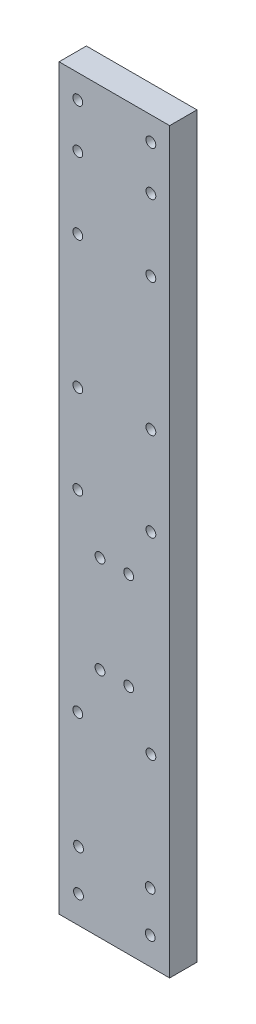
ISO-10303-21;
HEADER;
FILE_DESCRIPTION(('STEP AP214'),'2;1');
FILE_NAME('part.step','',(''),(''),'','','');
FILE_SCHEMA(('AUTOMOTIVE_DESIGN { 1 0 10303 214 1 1 1 1 }'));
ENDSEC;
DATA;
#1=APPLICATION_CONTEXT('core data for automotive mechanical design processes');
#2=APPLICATION_PROTOCOL_DEFINITION('international standard','automotive_design',2000,#1);
#3=PRODUCT_CONTEXT('',#1,'mechanical');
#4=PRODUCT('Part','Part','',(#3));
#5=PRODUCT_RELATED_PRODUCT_CATEGORY('part','',(#4));
#6=PRODUCT_DEFINITION_FORMATION('','',#4);
#7=PRODUCT_DEFINITION_CONTEXT('part definition',#1,'design');
#8=PRODUCT_DEFINITION('design','',#6,#7);
#9=PRODUCT_DEFINITION_SHAPE('','',#8);
#10=(LENGTH_UNIT() NAMED_UNIT(*) SI_UNIT(.MILLI.,.METRE.));
#11=(NAMED_UNIT(*) PLANE_ANGLE_UNIT() SI_UNIT($,.RADIAN.));
#12=(NAMED_UNIT(*) SI_UNIT($,.STERADIAN.) SOLID_ANGLE_UNIT());
#13=UNCERTAINTY_MEASURE_WITH_UNIT(LENGTH_MEASURE(1.E-05),#10,'distance_accuracy_value','');
#14=(GEOMETRIC_REPRESENTATION_CONTEXT(3) GLOBAL_UNCERTAINTY_ASSIGNED_CONTEXT((#13)) GLOBAL_UNIT_ASSIGNED_CONTEXT((#10,
#11,#12)) REPRESENTATION_CONTEXT('',''));
#15=CARTESIAN_POINT('',(0.,0.,0.));
#16=DIRECTION('',(0.,0.,1.));
#17=DIRECTION('',(1.,0.,0.));
#18=AXIS2_PLACEMENT_3D('',#15,#16,#17);
#19=CARTESIAN_POINT('',(0.,0.,4.));
#20=DIRECTION('',(0.,0.,1.));
#21=DIRECTION('',(1.,0.,0.));
#22=AXIS2_PLACEMENT_3D('',#19,#20,#21);
#23=PLANE('',#22);
#24=CARTESIAN_POINT('',(13.35,10.,4.));
#25=DIRECTION('',(0.,0.,1.));
#26=DIRECTION('',(-1.,0.,0.));
#27=AXIS2_PLACEMENT_3D('',#24,#25,#26);
#28=CIRCLE('',#27,0.72);
#29=CARTESIAN_POINT('',(12.63,10.,4.));
#30=VERTEX_POINT('',#29);
#31=EDGE_CURVE('E217',#30,#30,#28,.T.);
#32=ORIENTED_EDGE('',*,*,#31,.F.);
#33=EDGE_LOOP('',(#32));
#34=FACE_BOUND('',#33,.T.);
#35=CARTESIAN_POINT('',(2.85,10.,4.));
#36=DIRECTION('',(0.,0.,1.));
#37=DIRECTION('',(1.,0.,0.));
#38=AXIS2_PLACEMENT_3D('',#35,#36,#37);
#39=CIRCLE('',#38,0.72);
#40=CARTESIAN_POINT('',(3.57,10.,4.));
#41=VERTEX_POINT('',#40);
#42=EDGE_CURVE('E205',#41,#41,#39,.T.);
#43=ORIENTED_EDGE('',*,*,#42,.F.);
#44=EDGE_LOOP('',(#43));
#45=FACE_BOUND('',#44,.T.);
#46=CARTESIAN_POINT('',(2.74999999999998,68.21,4.));
#47=DIRECTION('',(0.,0.,1.));
#48=DIRECTION('',(1.,0.,0.));
#49=AXIS2_PLACEMENT_3D('',#46,#47,#48);
#50=CIRCLE('',#49,0.719999999999994);
#51=CARTESIAN_POINT('',(3.46999999999998,68.21,4.));
#52=VERTEX_POINT('',#51);
#53=EDGE_CURVE('E193',#52,#52,#50,.T.);
#54=ORIENTED_EDGE('',*,*,#53,.F.);
#55=EDGE_LOOP('',(#54));
#56=FACE_BOUND('',#55,.T.);
#57=CARTESIAN_POINT('',(2.74999999999999,55.21,4.));
#58=DIRECTION('',(0.,0.,1.));
#59=DIRECTION('',(1.,0.,0.));
#60=AXIS2_PLACEMENT_3D('',#57,#58,#59);
#61=CIRCLE('',#60,0.720000000000003);
#62=CARTESIAN_POINT('',(3.47,55.21,4.));
#63=VERTEX_POINT('',#62);
#64=EDGE_CURVE('E181',#63,#63,#61,.T.);
#65=ORIENTED_EDGE('',*,*,#64,.F.);
#66=EDGE_LOOP('',(#65));
#67=FACE_BOUND('',#66,.T.);
#68=CARTESIAN_POINT('',(13.45,104.66,4.));
#69=DIRECTION('',(0.,0.,1.));
#70=DIRECTION('',(-1.,0.,0.));
#71=AXIS2_PLACEMENT_3D('',#68,#69,#70);
#72=CIRCLE('',#71,0.71999999999999);
#73=CARTESIAN_POINT('',(12.73,104.66,4.));
#74=VERTEX_POINT('',#73);
#75=EDGE_CURVE('E169',#74,#74,#72,.T.);
#76=ORIENTED_EDGE('',*,*,#75,.F.);
#77=EDGE_LOOP('',(#76));
#78=FACE_BOUND('',#77,.T.);
#79=CARTESIAN_POINT('',(2.74999999999998,87.66,4.));
#80=DIRECTION('',(0.,0.,1.));
#81=DIRECTION('',(-1.,0.,0.));
#82=AXIS2_PLACEMENT_3D('',#79,#80,#81);
#83=CIRCLE('',#82,0.719999999999994);
#84=CARTESIAN_POINT('',(2.02999999999999,87.66,4.));
#85=VERTEX_POINT('',#84);
#86=EDGE_CURVE('E157',#85,#85,#83,.T.);
#87=ORIENTED_EDGE('',*,*,#86,.F.);
#88=EDGE_LOOP('',(#87));
#89=FACE_BOUND('',#88,.T.);
#90=CARTESIAN_POINT('',(2.75,27.,4.));
#91=DIRECTION('',(0.,0.,1.));
#92=DIRECTION('',(1.,0.,0.));
#93=AXIS2_PLACEMENT_3D('',#90,#91,#92);
#94=CIRCLE('',#93,0.72);
#95=CARTESIAN_POINT('',(3.47,27.,4.));
#96=VERTEX_POINT('',#95);
#97=EDGE_CURVE('E145',#96,#96,#94,.T.);
#98=ORIENTED_EDGE('',*,*,#97,.F.);
#99=EDGE_LOOP('',(#98));
#100=FACE_BOUND('',#99,.T.);
#101=CARTESIAN_POINT('',(6.,34.,4.));
#102=DIRECTION('',(0.,0.,1.));
#103=DIRECTION('',(1.,0.,0.));
#104=AXIS2_PLACEMENT_3D('',#101,#102,#103);
#105=CIRCLE('',#104,0.720000000000001);
#106=CARTESIAN_POINT('',(6.72,34.,4.));
#107=VERTEX_POINT('',#106);
#108=EDGE_CURVE('E133',#107,#107,#105,.T.);
#109=ORIENTED_EDGE('',*,*,#108,.F.);
#110=EDGE_LOOP('',(#109));
#111=FACE_BOUND('',#110,.T.);
#112=CARTESIAN_POINT('',(5.99999999999999,48.21,4.));
#113=DIRECTION('',(0.,0.,1.));
#114=DIRECTION('',(1.,0.,0.));
#115=AXIS2_PLACEMENT_3D('',#112,#113,#114);
#116=CIRCLE('',#115,0.720000000000002);
#117=CARTESIAN_POINT('',(6.72,48.21,4.));
#118=VERTEX_POINT('',#117);
#119=EDGE_CURVE('E121',#118,#118,#116,.T.);
#120=ORIENTED_EDGE('',*,*,#119,.F.);
#121=EDGE_LOOP('',(#120));
#122=FACE_BOUND('',#121,.T.);
#123=CARTESIAN_POINT('',(2.74999999999999,104.66,4.));
#124=DIRECTION('',(0.,0.,1.));
#125=DIRECTION('',(1.,0.,0.));
#126=AXIS2_PLACEMENT_3D('',#123,#124,#125);
#127=CIRCLE('',#126,0.719999999999994);
#128=CARTESIAN_POINT('',(3.46999999999998,104.66,4.));
#129=VERTEX_POINT('',#128);
#130=EDGE_CURVE('E100',#129,#129,#127,.T.);
#131=ORIENTED_EDGE('',*,*,#130,.F.);
#132=EDGE_LOOP('',(#131));
#133=FACE_BOUND('',#132,.T.);
#134=DIRECTION('',(0.,-1.,0.));
#135=VECTOR('',#134,1.);
#136=CARTESIAN_POINT('',(0.,108.14,4.));
#137=LINE('',#136,#135);
#138=CARTESIAN_POINT('',(0.,108.14,4.));
#139=VERTEX_POINT('',#138);
#140=CARTESIAN_POINT('',(0.,0.,4.));
#141=VERTEX_POINT('',#140);
#142=EDGE_CURVE('E85',#139,#141,#137,.T.);
#143=ORIENTED_EDGE('',*,*,#142,.T.);
#144=DIRECTION('',(1.,0.,0.));
#145=VECTOR('',#144,1.);
#146=CARTESIAN_POINT('',(0.,0.,4.));
#147=LINE('',#146,#145);
#148=CARTESIAN_POINT('',(16.2,0.,4.));
#149=VERTEX_POINT('',#148);
#150=EDGE_CURVE('E80',#141,#149,#147,.T.);
#151=ORIENTED_EDGE('',*,*,#150,.T.);
#152=DIRECTION('',(0.,1.,0.));
#153=VECTOR('',#152,1.);
#154=CARTESIAN_POINT('',(16.2,0.,4.));
#155=LINE('',#154,#153);
#156=CARTESIAN_POINT('',(16.2,108.14,4.));
#157=VERTEX_POINT('',#156);
#158=EDGE_CURVE('E83',#149,#157,#155,.T.);
#159=ORIENTED_EDGE('',*,*,#158,.T.);
#160=DIRECTION('',(-1.,0.,0.));
#161=VECTOR('',#160,1.);
#162=CARTESIAN_POINT('',(16.2,108.14,4.));
#163=LINE('',#162,#161);
#164=EDGE_CURVE('E50',#157,#139,#163,.T.);
#165=ORIENTED_EDGE('',*,*,#164,.T.);
#166=EDGE_LOOP('',(#143,#151,#159,#165));
#167=FACE_BOUND('',#166,.T.);
#168=CARTESIAN_POINT('',(10.2,48.21,4.));
#169=DIRECTION('',(0.,0.,1.));
#170=DIRECTION('',(1.,0.,0.));
#171=AXIS2_PLACEMENT_3D('',#168,#169,#170);
#172=CIRCLE('',#171,0.720000000000001);
#173=CARTESIAN_POINT('',(10.92,48.21,4.));
#174=VERTEX_POINT('',#173);
#175=EDGE_CURVE('E115',#174,#174,#172,.T.);
#176=ORIENTED_EDGE('',*,*,#175,.F.);
#177=EDGE_LOOP('',(#176));
#178=FACE_BOUND('',#177,.T.);
#179=CARTESIAN_POINT('',(10.2,34.,4.));
#180=DIRECTION('',(0.,0.,1.));
#181=DIRECTION('',(1.,0.,0.));
#182=AXIS2_PLACEMENT_3D('',#179,#180,#181);
#183=CIRCLE('',#182,0.720000000000001);
#184=CARTESIAN_POINT('',(10.92,34.,4.));
#185=VERTEX_POINT('',#184);
#186=EDGE_CURVE('E127',#185,#185,#183,.T.);
#187=ORIENTED_EDGE('',*,*,#186,.F.);
#188=EDGE_LOOP('',(#187));
#189=FACE_BOUND('',#188,.T.);
#190=CARTESIAN_POINT('',(13.45,27.,4.));
#191=DIRECTION('',(0.,0.,1.));
#192=DIRECTION('',(1.,0.,0.));
#193=AXIS2_PLACEMENT_3D('',#190,#191,#192);
#194=CIRCLE('',#193,0.72);
#195=CARTESIAN_POINT('',(14.17,27.,4.));
#196=VERTEX_POINT('',#195);
#197=EDGE_CURVE('E139',#196,#196,#194,.T.);
#198=ORIENTED_EDGE('',*,*,#197,.F.);
#199=EDGE_LOOP('',(#198));
#200=FACE_BOUND('',#199,.T.);
#201=CARTESIAN_POINT('',(13.45,55.21,4.));
#202=DIRECTION('',(0.,0.,1.));
#203=DIRECTION('',(1.,0.,0.));
#204=AXIS2_PLACEMENT_3D('',#201,#202,#203);
#205=CIRCLE('',#204,0.720000000000001);
#206=CARTESIAN_POINT('',(14.17,55.21,4.));
#207=VERTEX_POINT('',#206);
#208=EDGE_CURVE('E151',#207,#207,#205,.T.);
#209=ORIENTED_EDGE('',*,*,#208,.F.);
#210=EDGE_LOOP('',(#209));
#211=FACE_BOUND('',#210,.T.);
#212=CARTESIAN_POINT('',(13.45,87.66,4.));
#213=DIRECTION('',(0.,0.,1.));
#214=DIRECTION('',(-1.,0.,0.));
#215=AXIS2_PLACEMENT_3D('',#212,#213,#214);
#216=CIRCLE('',#215,0.71999999999999);
#217=CARTESIAN_POINT('',(12.73,87.66,4.));
#218=VERTEX_POINT('',#217);
#219=EDGE_CURVE('E163',#218,#218,#216,.T.);
#220=ORIENTED_EDGE('',*,*,#219,.F.);
#221=EDGE_LOOP('',(#220));
#222=FACE_BOUND('',#221,.T.);
#223=CARTESIAN_POINT('',(13.45,98.16,4.));
#224=DIRECTION('',(0.,0.,1.));
#225=DIRECTION('',(-1.,0.,0.));
#226=AXIS2_PLACEMENT_3D('',#223,#224,#225);
#227=CIRCLE('',#226,0.71999999999999);
#228=CARTESIAN_POINT('',(12.73,98.16,4.));
#229=VERTEX_POINT('',#228);
#230=EDGE_CURVE('E175',#229,#229,#227,.T.);
#231=ORIENTED_EDGE('',*,*,#230,.F.);
#232=EDGE_LOOP('',(#231));
#233=FACE_BOUND('',#232,.T.);
#234=CARTESIAN_POINT('',(13.45,68.21,4.));
#235=DIRECTION('',(0.,0.,1.));
#236=DIRECTION('',(1.,0.,0.));
#237=AXIS2_PLACEMENT_3D('',#234,#235,#236);
#238=CIRCLE('',#237,0.71999999999999);
#239=CARTESIAN_POINT('',(14.17,68.21,4.));
#240=VERTEX_POINT('',#239);
#241=EDGE_CURVE('E187',#240,#240,#238,.T.);
#242=ORIENTED_EDGE('',*,*,#241,.F.);
#243=EDGE_LOOP('',(#242));
#244=FACE_BOUND('',#243,.T.);
#245=CARTESIAN_POINT('',(2.74999999999999,98.16,4.));
#246=DIRECTION('',(0.,0.,1.));
#247=DIRECTION('',(1.,0.,0.));
#248=AXIS2_PLACEMENT_3D('',#245,#246,#247);
#249=CIRCLE('',#248,0.719999999999994);
#250=CARTESIAN_POINT('',(3.46999999999998,98.16,4.));
#251=VERTEX_POINT('',#250);
#252=EDGE_CURVE('E199',#251,#251,#249,.T.);
#253=ORIENTED_EDGE('',*,*,#252,.F.);
#254=EDGE_LOOP('',(#253));
#255=FACE_BOUND('',#254,.T.);
#256=CARTESIAN_POINT('',(2.85,4.,4.));
#257=DIRECTION('',(0.,0.,1.));
#258=DIRECTION('',(1.,0.,0.));
#259=AXIS2_PLACEMENT_3D('',#256,#257,#258);
#260=CIRCLE('',#259,0.72);
#261=CARTESIAN_POINT('',(3.57,4.,4.));
#262=VERTEX_POINT('',#261);
#263=EDGE_CURVE('E211',#262,#262,#260,.T.);
#264=ORIENTED_EDGE('',*,*,#263,.F.);
#265=EDGE_LOOP('',(#264));
#266=FACE_BOUND('',#265,.T.);
#267=CARTESIAN_POINT('',(13.35,4.,4.));
#268=DIRECTION('',(0.,0.,1.));
#269=DIRECTION('',(-1.,0.,0.));
#270=AXIS2_PLACEMENT_3D('',#267,#268,#269);
#271=CIRCLE('',#270,0.72);
#272=CARTESIAN_POINT('',(12.63,4.,4.));
#273=VERTEX_POINT('',#272);
#274=EDGE_CURVE('E223',#273,#273,#271,.T.);
#275=ORIENTED_EDGE('',*,*,#274,.F.);
#276=EDGE_LOOP('',(#275));
#277=FACE_BOUND('',#276,.T.);
#278=ADVANCED_FACE('F33',(#34,#45,#56,#67,#78,#89,#100,#111,#122,#133,#167,#178,#189,#200,#211,
#222,#233,#244,#255,#266,#277),#23,.T.);
#279=CARTESIAN_POINT('',(0.,0.,0.));
#280=DIRECTION('',(0.,0.,1.));
#281=DIRECTION('',(1.,0.,0.));
#282=AXIS2_PLACEMENT_3D('',#279,#280,#281);
#283=PLANE('',#282);
#284=CARTESIAN_POINT('',(13.35,10.,0.));
#285=DIRECTION('',(0.,0.,1.));
#286=DIRECTION('',(-1.,0.,0.));
#287=AXIS2_PLACEMENT_3D('',#284,#285,#286);
#288=CIRCLE('',#287,0.72);
#289=CARTESIAN_POINT('',(12.63,10.,0.));
#290=VERTEX_POINT('',#289);
#291=EDGE_CURVE('E220',#290,#290,#288,.T.);
#292=ORIENTED_EDGE('',*,*,#291,.T.);
#293=EDGE_LOOP('',(#292));
#294=FACE_BOUND('',#293,.T.);
#295=CARTESIAN_POINT('',(2.85,10.,0.));
#296=DIRECTION('',(0.,0.,1.));
#297=DIRECTION('',(1.,0.,0.));
#298=AXIS2_PLACEMENT_3D('',#295,#296,#297);
#299=CIRCLE('',#298,0.72);
#300=CARTESIAN_POINT('',(3.57,10.,0.));
#301=VERTEX_POINT('',#300);
#302=EDGE_CURVE('E208',#301,#301,#299,.T.);
#303=ORIENTED_EDGE('',*,*,#302,.T.);
#304=EDGE_LOOP('',(#303));
#305=FACE_BOUND('',#304,.T.);
#306=CARTESIAN_POINT('',(2.74999999999998,68.21,0.));
#307=DIRECTION('',(0.,0.,1.));
#308=DIRECTION('',(1.,0.,0.));
#309=AXIS2_PLACEMENT_3D('',#306,#307,#308);
#310=CIRCLE('',#309,0.719999999999994);
#311=CARTESIAN_POINT('',(3.46999999999998,68.21,0.));
#312=VERTEX_POINT('',#311);
#313=EDGE_CURVE('E196',#312,#312,#310,.T.);
#314=ORIENTED_EDGE('',*,*,#313,.T.);
#315=EDGE_LOOP('',(#314));
#316=FACE_BOUND('',#315,.T.);
#317=CARTESIAN_POINT('',(2.74999999999999,55.21,0.));
#318=DIRECTION('',(0.,0.,1.));
#319=DIRECTION('',(1.,0.,0.));
#320=AXIS2_PLACEMENT_3D('',#317,#318,#319);
#321=CIRCLE('',#320,0.720000000000003);
#322=CARTESIAN_POINT('',(3.47,55.21,0.));
#323=VERTEX_POINT('',#322);
#324=EDGE_CURVE('E184',#323,#323,#321,.T.);
#325=ORIENTED_EDGE('',*,*,#324,.T.);
#326=EDGE_LOOP('',(#325));
#327=FACE_BOUND('',#326,.T.);
#328=CARTESIAN_POINT('',(13.45,104.66,0.));
#329=DIRECTION('',(0.,0.,1.));
#330=DIRECTION('',(-1.,0.,0.));
#331=AXIS2_PLACEMENT_3D('',#328,#329,#330);
#332=CIRCLE('',#331,0.71999999999999);
#333=CARTESIAN_POINT('',(12.73,104.66,0.));
#334=VERTEX_POINT('',#333);
#335=EDGE_CURVE('E172',#334,#334,#332,.T.);
#336=ORIENTED_EDGE('',*,*,#335,.T.);
#337=EDGE_LOOP('',(#336));
#338=FACE_BOUND('',#337,.T.);
#339=CARTESIAN_POINT('',(2.74999999999998,87.66,0.));
#340=DIRECTION('',(0.,0.,1.));
#341=DIRECTION('',(-1.,0.,0.));
#342=AXIS2_PLACEMENT_3D('',#339,#340,#341);
#343=CIRCLE('',#342,0.719999999999994);
#344=CARTESIAN_POINT('',(2.02999999999999,87.66,0.));
#345=VERTEX_POINT('',#344);
#346=EDGE_CURVE('E160',#345,#345,#343,.T.);
#347=ORIENTED_EDGE('',*,*,#346,.T.);
#348=EDGE_LOOP('',(#347));
#349=FACE_BOUND('',#348,.T.);
#350=CARTESIAN_POINT('',(2.75,27.,0.));
#351=DIRECTION('',(0.,0.,1.));
#352=DIRECTION('',(1.,0.,0.));
#353=AXIS2_PLACEMENT_3D('',#350,#351,#352);
#354=CIRCLE('',#353,0.72);
#355=CARTESIAN_POINT('',(3.47,27.,0.));
#356=VERTEX_POINT('',#355);
#357=EDGE_CURVE('E148',#356,#356,#354,.T.);
#358=ORIENTED_EDGE('',*,*,#357,.T.);
#359=EDGE_LOOP('',(#358));
#360=FACE_BOUND('',#359,.T.);
#361=CARTESIAN_POINT('',(6.,34.,0.));
#362=DIRECTION('',(0.,0.,1.));
#363=DIRECTION('',(1.,0.,0.));
#364=AXIS2_PLACEMENT_3D('',#361,#362,#363);
#365=CIRCLE('',#364,0.720000000000001);
#366=CARTESIAN_POINT('',(6.72,34.,0.));
#367=VERTEX_POINT('',#366);
#368=EDGE_CURVE('E136',#367,#367,#365,.T.);
#369=ORIENTED_EDGE('',*,*,#368,.T.);
#370=EDGE_LOOP('',(#369));
#371=FACE_BOUND('',#370,.T.);
#372=CARTESIAN_POINT('',(5.99999999999999,48.21,0.));
#373=DIRECTION('',(0.,0.,1.));
#374=DIRECTION('',(1.,0.,0.));
#375=AXIS2_PLACEMENT_3D('',#372,#373,#374);
#376=CIRCLE('',#375,0.720000000000002);
#377=CARTESIAN_POINT('',(6.72,48.21,0.));
#378=VERTEX_POINT('',#377);
#379=EDGE_CURVE('E124',#378,#378,#376,.T.);
#380=ORIENTED_EDGE('',*,*,#379,.T.);
#381=EDGE_LOOP('',(#380));
#382=FACE_BOUND('',#381,.T.);
#383=CARTESIAN_POINT('',(2.74999999999999,104.66,0.));
#384=DIRECTION('',(0.,0.,1.));
#385=DIRECTION('',(1.,0.,0.));
#386=AXIS2_PLACEMENT_3D('',#383,#384,#385);
#387=CIRCLE('',#386,0.719999999999994);
#388=CARTESIAN_POINT('',(3.46999999999998,104.66,0.));
#389=VERTEX_POINT('',#388);
#390=EDGE_CURVE('E112',#389,#389,#387,.T.);
#391=ORIENTED_EDGE('',*,*,#390,.T.);
#392=EDGE_LOOP('',(#391));
#393=FACE_BOUND('',#392,.T.);
#394=DIRECTION('',(0.,-1.,0.));
#395=VECTOR('',#394,1.);
#396=CARTESIAN_POINT('',(0.,108.14,0.));
#397=LINE('',#396,#395);
#398=CARTESIAN_POINT('',(0.,108.14,0.));
#399=VERTEX_POINT('',#398);
#400=CARTESIAN_POINT('',(0.,0.,0.));
#401=VERTEX_POINT('',#400);
#402=EDGE_CURVE('E97',#399,#401,#397,.T.);
#403=ORIENTED_EDGE('',*,*,#402,.F.);
#404=DIRECTION('',(-1.,0.,0.));
#405=VECTOR('',#404,1.);
#406=CARTESIAN_POINT('',(16.2,108.14,0.));
#407=LINE('',#406,#405);
#408=CARTESIAN_POINT('',(16.2,108.14,0.));
#409=VERTEX_POINT('',#408);
#410=EDGE_CURVE('E73',#409,#399,#407,.T.);
#411=ORIENTED_EDGE('',*,*,#410,.F.);
#412=DIRECTION('',(0.,1.,0.));
#413=VECTOR('',#412,1.);
#414=CARTESIAN_POINT('',(16.2,0.,0.));
#415=LINE('',#414,#413);
#416=CARTESIAN_POINT('',(16.2,0.,0.));
#417=VERTEX_POINT('',#416);
#418=EDGE_CURVE('E67',#417,#409,#415,.T.);
#419=ORIENTED_EDGE('',*,*,#418,.F.);
#420=DIRECTION('',(1.,0.,0.));
#421=VECTOR('',#420,1.);
#422=CARTESIAN_POINT('',(0.,0.,0.));
#423=LINE('',#422,#421);
#424=EDGE_CURVE('E89',#401,#417,#423,.T.);
#425=ORIENTED_EDGE('',*,*,#424,.F.);
#426=EDGE_LOOP('',(#403,#411,#419,#425));
#427=FACE_BOUND('',#426,.T.);
#428=CARTESIAN_POINT('',(10.2,48.21,0.));
#429=DIRECTION('',(0.,0.,1.));
#430=DIRECTION('',(1.,0.,0.));
#431=AXIS2_PLACEMENT_3D('',#428,#429,#430);
#432=CIRCLE('',#431,0.720000000000001);
#433=CARTESIAN_POINT('',(10.92,48.21,0.));
#434=VERTEX_POINT('',#433);
#435=EDGE_CURVE('E118',#434,#434,#432,.T.);
#436=ORIENTED_EDGE('',*,*,#435,.T.);
#437=EDGE_LOOP('',(#436));
#438=FACE_BOUND('',#437,.T.);
#439=CARTESIAN_POINT('',(10.2,34.,0.));
#440=DIRECTION('',(0.,0.,1.));
#441=DIRECTION('',(1.,0.,0.));
#442=AXIS2_PLACEMENT_3D('',#439,#440,#441);
#443=CIRCLE('',#442,0.720000000000001);
#444=CARTESIAN_POINT('',(10.92,34.,0.));
#445=VERTEX_POINT('',#444);
#446=EDGE_CURVE('E130',#445,#445,#443,.T.);
#447=ORIENTED_EDGE('',*,*,#446,.T.);
#448=EDGE_LOOP('',(#447));
#449=FACE_BOUND('',#448,.T.);
#450=CARTESIAN_POINT('',(13.45,27.,0.));
#451=DIRECTION('',(0.,0.,1.));
#452=DIRECTION('',(1.,0.,0.));
#453=AXIS2_PLACEMENT_3D('',#450,#451,#452);
#454=CIRCLE('',#453,0.72);
#455=CARTESIAN_POINT('',(14.17,27.,0.));
#456=VERTEX_POINT('',#455);
#457=EDGE_CURVE('E142',#456,#456,#454,.T.);
#458=ORIENTED_EDGE('',*,*,#457,.T.);
#459=EDGE_LOOP('',(#458));
#460=FACE_BOUND('',#459,.T.);
#461=CARTESIAN_POINT('',(13.45,55.21,0.));
#462=DIRECTION('',(0.,0.,1.));
#463=DIRECTION('',(1.,0.,0.));
#464=AXIS2_PLACEMENT_3D('',#461,#462,#463);
#465=CIRCLE('',#464,0.720000000000001);
#466=CARTESIAN_POINT('',(14.17,55.21,0.));
#467=VERTEX_POINT('',#466);
#468=EDGE_CURVE('E154',#467,#467,#465,.T.);
#469=ORIENTED_EDGE('',*,*,#468,.T.);
#470=EDGE_LOOP('',(#469));
#471=FACE_BOUND('',#470,.T.);
#472=CARTESIAN_POINT('',(13.45,87.66,0.));
#473=DIRECTION('',(0.,0.,1.));
#474=DIRECTION('',(-1.,0.,0.));
#475=AXIS2_PLACEMENT_3D('',#472,#473,#474);
#476=CIRCLE('',#475,0.71999999999999);
#477=CARTESIAN_POINT('',(12.73,87.66,0.));
#478=VERTEX_POINT('',#477);
#479=EDGE_CURVE('E166',#478,#478,#476,.T.);
#480=ORIENTED_EDGE('',*,*,#479,.T.);
#481=EDGE_LOOP('',(#480));
#482=FACE_BOUND('',#481,.T.);
#483=CARTESIAN_POINT('',(13.45,98.16,0.));
#484=DIRECTION('',(0.,0.,1.));
#485=DIRECTION('',(-1.,0.,0.));
#486=AXIS2_PLACEMENT_3D('',#483,#484,#485);
#487=CIRCLE('',#486,0.71999999999999);
#488=CARTESIAN_POINT('',(12.73,98.16,0.));
#489=VERTEX_POINT('',#488);
#490=EDGE_CURVE('E178',#489,#489,#487,.T.);
#491=ORIENTED_EDGE('',*,*,#490,.T.);
#492=EDGE_LOOP('',(#491));
#493=FACE_BOUND('',#492,.T.);
#494=CARTESIAN_POINT('',(13.45,68.21,0.));
#495=DIRECTION('',(0.,0.,1.));
#496=DIRECTION('',(1.,0.,0.));
#497=AXIS2_PLACEMENT_3D('',#494,#495,#496);
#498=CIRCLE('',#497,0.71999999999999);
#499=CARTESIAN_POINT('',(14.17,68.21,0.));
#500=VERTEX_POINT('',#499);
#501=EDGE_CURVE('E190',#500,#500,#498,.T.);
#502=ORIENTED_EDGE('',*,*,#501,.T.);
#503=EDGE_LOOP('',(#502));
#504=FACE_BOUND('',#503,.T.);
#505=CARTESIAN_POINT('',(2.74999999999999,98.16,0.));
#506=DIRECTION('',(0.,0.,1.));
#507=DIRECTION('',(1.,0.,0.));
#508=AXIS2_PLACEMENT_3D('',#505,#506,#507);
#509=CIRCLE('',#508,0.719999999999994);
#510=CARTESIAN_POINT('',(3.46999999999998,98.16,0.));
#511=VERTEX_POINT('',#510);
#512=EDGE_CURVE('E202',#511,#511,#509,.T.);
#513=ORIENTED_EDGE('',*,*,#512,.T.);
#514=EDGE_LOOP('',(#513));
#515=FACE_BOUND('',#514,.T.);
#516=CARTESIAN_POINT('',(2.85,4.,0.));
#517=DIRECTION('',(0.,0.,1.));
#518=DIRECTION('',(1.,0.,0.));
#519=AXIS2_PLACEMENT_3D('',#516,#517,#518);
#520=CIRCLE('',#519,0.72);
#521=CARTESIAN_POINT('',(3.57,4.,0.));
#522=VERTEX_POINT('',#521);
#523=EDGE_CURVE('E214',#522,#522,#520,.T.);
#524=ORIENTED_EDGE('',*,*,#523,.T.);
#525=EDGE_LOOP('',(#524));
#526=FACE_BOUND('',#525,.T.);
#527=CARTESIAN_POINT('',(13.35,4.,0.));
#528=DIRECTION('',(0.,0.,1.));
#529=DIRECTION('',(-1.,0.,0.));
#530=AXIS2_PLACEMENT_3D('',#527,#528,#529);
#531=CIRCLE('',#530,0.72);
#532=CARTESIAN_POINT('',(12.63,4.,0.));
#533=VERTEX_POINT('',#532);
#534=EDGE_CURVE('E226',#533,#533,#531,.T.);
#535=ORIENTED_EDGE('',*,*,#534,.T.);
#536=EDGE_LOOP('',(#535));
#537=FACE_BOUND('',#536,.T.);
#538=ADVANCED_FACE('F108',(#294,#305,#316,#327,#338,#349,#360,#371,#382,#393,#427,#438,#449,
#460,#471,#482,#493,#504,#515,#526,#537),#283,.F.);
#539=CARTESIAN_POINT('',(0.,108.14,4.));
#540=DIRECTION('',(1.,0.,0.));
#541=DIRECTION('',(0.,1.,0.));
#542=AXIS2_PLACEMENT_3D('',#539,#540,#541);
#543=PLANE('',#542);
#544=ORIENTED_EDGE('',*,*,#402,.T.);
#545=DIRECTION('',(0.,0.,-1.));
#546=VECTOR('',#545,1.);
#547=CARTESIAN_POINT('',(0.,0.,4.));
#548=LINE('',#547,#546);
#549=EDGE_CURVE('E11',#141,#401,#548,.T.);
#550=ORIENTED_EDGE('',*,*,#549,.F.);
#551=ORIENTED_EDGE('',*,*,#142,.F.);
#552=DIRECTION('',(0.,0.,-1.));
#553=VECTOR('',#552,1.);
#554=CARTESIAN_POINT('',(0.,108.14,4.));
#555=LINE('',#554,#553);
#556=EDGE_CURVE('E93',#139,#399,#555,.T.);
#557=ORIENTED_EDGE('',*,*,#556,.T.);
#558=EDGE_LOOP('',(#544,#550,#551,#557));
#559=FACE_BOUND('',#558,.T.);
#560=ADVANCED_FACE('F35',(#559),#543,.F.);
#561=CARTESIAN_POINT('',(0.,0.,4.));
#562=DIRECTION('',(0.,1.,0.));
#563=DIRECTION('',(-1.,0.,0.));
#564=AXIS2_PLACEMENT_3D('',#561,#562,#563);
#565=PLANE('',#564);
#566=ORIENTED_EDGE('',*,*,#424,.T.);
#567=DIRECTION('',(0.,0.,-1.));
#568=VECTOR('',#567,1.);
#569=CARTESIAN_POINT('',(16.2,0.,4.));
#570=LINE('',#569,#568);
#571=EDGE_CURVE('E42',#149,#417,#570,.T.);
#572=ORIENTED_EDGE('',*,*,#571,.F.);
#573=ORIENTED_EDGE('',*,*,#150,.F.);
#574=ORIENTED_EDGE('',*,*,#549,.T.);
#575=EDGE_LOOP('',(#566,#572,#573,#574));
#576=FACE_BOUND('',#575,.T.);
#577=ADVANCED_FACE('F88',(#576),#565,.F.);
#578=CARTESIAN_POINT('',(16.2,0.,4.));
#579=DIRECTION('',(-1.,0.,0.));
#580=DIRECTION('',(0.,-1.,0.));
#581=AXIS2_PLACEMENT_3D('',#578,#579,#580);
#582=PLANE('',#581);
#583=ORIENTED_EDGE('',*,*,#418,.T.);
#584=DIRECTION('',(0.,0.,-1.));
#585=VECTOR('',#584,1.);
#586=CARTESIAN_POINT('',(16.2,108.14,4.));
#587=LINE('',#586,#585);
#588=EDGE_CURVE('E90',#157,#409,#587,.T.);
#589=ORIENTED_EDGE('',*,*,#588,.F.);
#590=ORIENTED_EDGE('',*,*,#158,.F.);
#591=ORIENTED_EDGE('',*,*,#571,.T.);
#592=EDGE_LOOP('',(#583,#589,#590,#591));
#593=FACE_BOUND('',#592,.T.);
#594=ADVANCED_FACE('F91',(#593),#582,.F.);
#595=CARTESIAN_POINT('',(16.2,108.14,4.));
#596=DIRECTION('',(0.,-1.,0.));
#597=DIRECTION('',(0.,0.,-1.));
#598=AXIS2_PLACEMENT_3D('',#595,#596,#597);
#599=PLANE('',#598);
#600=ORIENTED_EDGE('',*,*,#410,.T.);
#601=ORIENTED_EDGE('',*,*,#556,.F.);
#602=ORIENTED_EDGE('',*,*,#164,.F.);
#603=ORIENTED_EDGE('',*,*,#588,.T.);
#604=EDGE_LOOP('',(#600,#601,#602,#603));
#605=FACE_BOUND('',#604,.T.);
#606=ADVANCED_FACE('F105',(#605),#599,.F.);
#607=CARTESIAN_POINT('',(2.74999999999999,104.66,4.));
#608=DIRECTION('',(0.,0.,-1.));
#609=DIRECTION('',(-1.,0.,0.));
#610=AXIS2_PLACEMENT_3D('',#607,#608,#609);
#611=CYLINDRICAL_SURFACE('',#610,0.719999999999994);
#612=ORIENTED_EDGE('',*,*,#130,.T.);
#613=EDGE_LOOP('',(#612));
#614=FACE_BOUND('',#613,.T.);
#615=ORIENTED_EDGE('',*,*,#390,.F.);
#616=EDGE_LOOP('',(#615));
#617=FACE_BOUND('',#616,.T.);
#618=ADVANCED_FACE('F246',(#614,#617),#611,.F.);
#619=CARTESIAN_POINT('',(10.2,48.21,4.));
#620=DIRECTION('',(0.,0.,-1.));
#621=DIRECTION('',(-1.,0.,0.));
#622=AXIS2_PLACEMENT_3D('',#619,#620,#621);
#623=CYLINDRICAL_SURFACE('',#622,0.720000000000001);
#624=ORIENTED_EDGE('',*,*,#175,.T.);
#625=EDGE_LOOP('',(#624));
#626=FACE_BOUND('',#625,.T.);
#627=ORIENTED_EDGE('',*,*,#435,.F.);
#628=EDGE_LOOP('',(#627));
#629=FACE_BOUND('',#628,.T.);
#630=ADVANCED_FACE('F292',(#626,#629),#623,.F.);
#631=CARTESIAN_POINT('',(5.99999999999999,48.21,4.));
#632=DIRECTION('',(0.,0.,-1.));
#633=DIRECTION('',(-1.,0.,0.));
#634=AXIS2_PLACEMENT_3D('',#631,#632,#633);
#635=CYLINDRICAL_SURFACE('',#634,0.720000000000002);
#636=ORIENTED_EDGE('',*,*,#119,.T.);
#637=EDGE_LOOP('',(#636));
#638=FACE_BOUND('',#637,.T.);
#639=ORIENTED_EDGE('',*,*,#379,.F.);
#640=EDGE_LOOP('',(#639));
#641=FACE_BOUND('',#640,.T.);
#642=ADVANCED_FACE('F300',(#638,#641),#635,.F.);
#643=CARTESIAN_POINT('',(10.2,34.,4.));
#644=DIRECTION('',(0.,0.,-1.));
#645=DIRECTION('',(-1.,0.,0.));
#646=AXIS2_PLACEMENT_3D('',#643,#644,#645);
#647=CYLINDRICAL_SURFACE('',#646,0.720000000000001);
#648=ORIENTED_EDGE('',*,*,#186,.T.);
#649=EDGE_LOOP('',(#648));
#650=FACE_BOUND('',#649,.T.);
#651=ORIENTED_EDGE('',*,*,#446,.F.);
#652=EDGE_LOOP('',(#651));
#653=FACE_BOUND('',#652,.T.);
#654=ADVANCED_FACE('F308',(#650,#653),#647,.F.);
#655=CARTESIAN_POINT('',(6.,34.,4.));
#656=DIRECTION('',(0.,0.,-1.));
#657=DIRECTION('',(-1.,0.,0.));
#658=AXIS2_PLACEMENT_3D('',#655,#656,#657);
#659=CYLINDRICAL_SURFACE('',#658,0.720000000000001);
#660=ORIENTED_EDGE('',*,*,#108,.T.);
#661=EDGE_LOOP('',(#660));
#662=FACE_BOUND('',#661,.T.);
#663=ORIENTED_EDGE('',*,*,#368,.F.);
#664=EDGE_LOOP('',(#663));
#665=FACE_BOUND('',#664,.T.);
#666=ADVANCED_FACE('F317',(#662,#665),#659,.F.);
#667=CARTESIAN_POINT('',(13.45,27.,4.));
#668=DIRECTION('',(0.,0.,-1.));
#669=DIRECTION('',(-1.,0.,0.));
#670=AXIS2_PLACEMENT_3D('',#667,#668,#669);
#671=CYLINDRICAL_SURFACE('',#670,0.72);
#672=ORIENTED_EDGE('',*,*,#197,.T.);
#673=EDGE_LOOP('',(#672));
#674=FACE_BOUND('',#673,.T.);
#675=ORIENTED_EDGE('',*,*,#457,.F.);
#676=EDGE_LOOP('',(#675));
#677=FACE_BOUND('',#676,.T.);
#678=ADVANCED_FACE('F326',(#674,#677),#671,.F.);
#679=CARTESIAN_POINT('',(2.75,27.,4.));
#680=DIRECTION('',(0.,0.,-1.));
#681=DIRECTION('',(-1.,0.,0.));
#682=AXIS2_PLACEMENT_3D('',#679,#680,#681);
#683=CYLINDRICAL_SURFACE('',#682,0.72);
#684=ORIENTED_EDGE('',*,*,#97,.T.);
#685=EDGE_LOOP('',(#684));
#686=FACE_BOUND('',#685,.T.);
#687=ORIENTED_EDGE('',*,*,#357,.F.);
#688=EDGE_LOOP('',(#687));
#689=FACE_BOUND('',#688,.T.);
#690=ADVANCED_FACE('F335',(#686,#689),#683,.F.);
#691=CARTESIAN_POINT('',(13.45,55.21,4.));
#692=DIRECTION('',(0.,0.,-1.));
#693=DIRECTION('',(-1.,0.,0.));
#694=AXIS2_PLACEMENT_3D('',#691,#692,#693);
#695=CYLINDRICAL_SURFACE('',#694,0.720000000000001);
#696=ORIENTED_EDGE('',*,*,#208,.T.);
#697=EDGE_LOOP('',(#696));
#698=FACE_BOUND('',#697,.T.);
#699=ORIENTED_EDGE('',*,*,#468,.F.);
#700=EDGE_LOOP('',(#699));
#701=FACE_BOUND('',#700,.T.);
#702=ADVANCED_FACE('F344',(#698,#701),#695,.F.);
#703=CARTESIAN_POINT('',(2.74999999999998,87.66,4.));
#704=DIRECTION('',(0.,0.,-1.));
#705=DIRECTION('',(-1.,0.,0.));
#706=AXIS2_PLACEMENT_3D('',#703,#704,#705);
#707=CYLINDRICAL_SURFACE('',#706,0.719999999999994);
#708=ORIENTED_EDGE('',*,*,#86,.T.);
#709=EDGE_LOOP('',(#708));
#710=FACE_BOUND('',#709,.T.);
#711=ORIENTED_EDGE('',*,*,#346,.F.);
#712=EDGE_LOOP('',(#711));
#713=FACE_BOUND('',#712,.T.);
#714=ADVANCED_FACE('F353',(#710,#713),#707,.F.);
#715=CARTESIAN_POINT('',(13.45,87.66,4.));
#716=DIRECTION('',(0.,0.,-1.));
#717=DIRECTION('',(-1.,0.,0.));
#718=AXIS2_PLACEMENT_3D('',#715,#716,#717);
#719=CYLINDRICAL_SURFACE('',#718,0.71999999999999);
#720=ORIENTED_EDGE('',*,*,#219,.T.);
#721=EDGE_LOOP('',(#720));
#722=FACE_BOUND('',#721,.T.);
#723=ORIENTED_EDGE('',*,*,#479,.F.);
#724=EDGE_LOOP('',(#723));
#725=FACE_BOUND('',#724,.T.);
#726=ADVANCED_FACE('F362',(#722,#725),#719,.F.);
#727=CARTESIAN_POINT('',(13.45,104.66,4.));
#728=DIRECTION('',(0.,0.,-1.));
#729=DIRECTION('',(-1.,0.,0.));
#730=AXIS2_PLACEMENT_3D('',#727,#728,#729);
#731=CYLINDRICAL_SURFACE('',#730,0.71999999999999);
#732=ORIENTED_EDGE('',*,*,#75,.T.);
#733=EDGE_LOOP('',(#732));
#734=FACE_BOUND('',#733,.T.);
#735=ORIENTED_EDGE('',*,*,#335,.F.);
#736=EDGE_LOOP('',(#735));
#737=FACE_BOUND('',#736,.T.);
#738=ADVANCED_FACE('F371',(#734,#737),#731,.F.);
#739=CARTESIAN_POINT('',(13.45,98.16,4.));
#740=DIRECTION('',(0.,0.,-1.));
#741=DIRECTION('',(-1.,0.,0.));
#742=AXIS2_PLACEMENT_3D('',#739,#740,#741);
#743=CYLINDRICAL_SURFACE('',#742,0.71999999999999);
#744=ORIENTED_EDGE('',*,*,#230,.T.);
#745=EDGE_LOOP('',(#744));
#746=FACE_BOUND('',#745,.T.);
#747=ORIENTED_EDGE('',*,*,#490,.F.);
#748=EDGE_LOOP('',(#747));
#749=FACE_BOUND('',#748,.T.);
#750=ADVANCED_FACE('F380',(#746,#749),#743,.F.);
#751=CARTESIAN_POINT('',(2.74999999999999,55.21,4.));
#752=DIRECTION('',(0.,0.,-1.));
#753=DIRECTION('',(-1.,0.,0.));
#754=AXIS2_PLACEMENT_3D('',#751,#752,#753);
#755=CYLINDRICAL_SURFACE('',#754,0.720000000000003);
#756=ORIENTED_EDGE('',*,*,#64,.T.);
#757=EDGE_LOOP('',(#756));
#758=FACE_BOUND('',#757,.T.);
#759=ORIENTED_EDGE('',*,*,#324,.F.);
#760=EDGE_LOOP('',(#759));
#761=FACE_BOUND('',#760,.T.);
#762=ADVANCED_FACE('F389',(#758,#761),#755,.F.);
#763=CARTESIAN_POINT('',(13.45,68.21,4.));
#764=DIRECTION('',(0.,0.,-1.));
#765=DIRECTION('',(-1.,0.,0.));
#766=AXIS2_PLACEMENT_3D('',#763,#764,#765);
#767=CYLINDRICAL_SURFACE('',#766,0.71999999999999);
#768=ORIENTED_EDGE('',*,*,#241,.T.);
#769=EDGE_LOOP('',(#768));
#770=FACE_BOUND('',#769,.T.);
#771=ORIENTED_EDGE('',*,*,#501,.F.);
#772=EDGE_LOOP('',(#771));
#773=FACE_BOUND('',#772,.T.);
#774=ADVANCED_FACE('F398',(#770,#773),#767,.F.);
#775=CARTESIAN_POINT('',(2.74999999999998,68.21,4.));
#776=DIRECTION('',(0.,0.,-1.));
#777=DIRECTION('',(-1.,0.,0.));
#778=AXIS2_PLACEMENT_3D('',#775,#776,#777);
#779=CYLINDRICAL_SURFACE('',#778,0.719999999999994);
#780=ORIENTED_EDGE('',*,*,#53,.T.);
#781=EDGE_LOOP('',(#780));
#782=FACE_BOUND('',#781,.T.);
#783=ORIENTED_EDGE('',*,*,#313,.F.);
#784=EDGE_LOOP('',(#783));
#785=FACE_BOUND('',#784,.T.);
#786=ADVANCED_FACE('F407',(#782,#785),#779,.F.);
#787=CARTESIAN_POINT('',(2.74999999999999,98.16,4.));
#788=DIRECTION('',(0.,0.,-1.));
#789=DIRECTION('',(-1.,0.,0.));
#790=AXIS2_PLACEMENT_3D('',#787,#788,#789);
#791=CYLINDRICAL_SURFACE('',#790,0.719999999999994);
#792=ORIENTED_EDGE('',*,*,#252,.T.);
#793=EDGE_LOOP('',(#792));
#794=FACE_BOUND('',#793,.T.);
#795=ORIENTED_EDGE('',*,*,#512,.F.);
#796=EDGE_LOOP('',(#795));
#797=FACE_BOUND('',#796,.T.);
#798=ADVANCED_FACE('F416',(#794,#797),#791,.F.);
#799=CARTESIAN_POINT('',(2.85,10.,4.));
#800=DIRECTION('',(0.,0.,-1.));
#801=DIRECTION('',(-1.,0.,0.));
#802=AXIS2_PLACEMENT_3D('',#799,#800,#801);
#803=CYLINDRICAL_SURFACE('',#802,0.72);
#804=ORIENTED_EDGE('',*,*,#42,.T.);
#805=EDGE_LOOP('',(#804));
#806=FACE_BOUND('',#805,.T.);
#807=ORIENTED_EDGE('',*,*,#302,.F.);
#808=EDGE_LOOP('',(#807));
#809=FACE_BOUND('',#808,.T.);
#810=ADVANCED_FACE('F425',(#806,#809),#803,.F.);
#811=CARTESIAN_POINT('',(2.85,4.,4.));
#812=DIRECTION('',(0.,0.,-1.));
#813=DIRECTION('',(-1.,0.,0.));
#814=AXIS2_PLACEMENT_3D('',#811,#812,#813);
#815=CYLINDRICAL_SURFACE('',#814,0.72);
#816=ORIENTED_EDGE('',*,*,#263,.T.);
#817=EDGE_LOOP('',(#816));
#818=FACE_BOUND('',#817,.T.);
#819=ORIENTED_EDGE('',*,*,#523,.F.);
#820=EDGE_LOOP('',(#819));
#821=FACE_BOUND('',#820,.T.);
#822=ADVANCED_FACE('F434',(#818,#821),#815,.F.);
#823=CARTESIAN_POINT('',(13.35,10.,4.));
#824=DIRECTION('',(0.,0.,-1.));
#825=DIRECTION('',(-1.,0.,0.));
#826=AXIS2_PLACEMENT_3D('',#823,#824,#825);
#827=CYLINDRICAL_SURFACE('',#826,0.72);
#828=ORIENTED_EDGE('',*,*,#31,.T.);
#829=EDGE_LOOP('',(#828));
#830=FACE_BOUND('',#829,.T.);
#831=ORIENTED_EDGE('',*,*,#291,.F.);
#832=EDGE_LOOP('',(#831));
#833=FACE_BOUND('',#832,.T.);
#834=ADVANCED_FACE('F443',(#830,#833),#827,.F.);
#835=CARTESIAN_POINT('',(13.35,4.,4.));
#836=DIRECTION('',(0.,0.,-1.));
#837=DIRECTION('',(-1.,0.,0.));
#838=AXIS2_PLACEMENT_3D('',#835,#836,#837);
#839=CYLINDRICAL_SURFACE('',#838,0.72);
#840=ORIENTED_EDGE('',*,*,#274,.T.);
#841=EDGE_LOOP('',(#840));
#842=FACE_BOUND('',#841,.T.);
#843=ORIENTED_EDGE('',*,*,#534,.F.);
#844=EDGE_LOOP('',(#843));
#845=FACE_BOUND('',#844,.T.);
#846=ADVANCED_FACE('F232',(#842,#845),#839,.F.);
#847=CLOSED_SHELL('',(#278,#538,#560,#577,#594,#606,#618,#630,#642,#654,#666,#678,#690,#702,
#714,#726,#738,#750,#762,#774,#786,#798,#810,#822,#834,#846));
#848=MANIFOLD_SOLID_BREP('B2',#847);
#849=ADVANCED_BREP_SHAPE_REPRESENTATION('',(#18,#848),#14);
#850=SHAPE_DEFINITION_REPRESENTATION(#9,#849);
ENDSEC;
END-ISO-10303-21;
